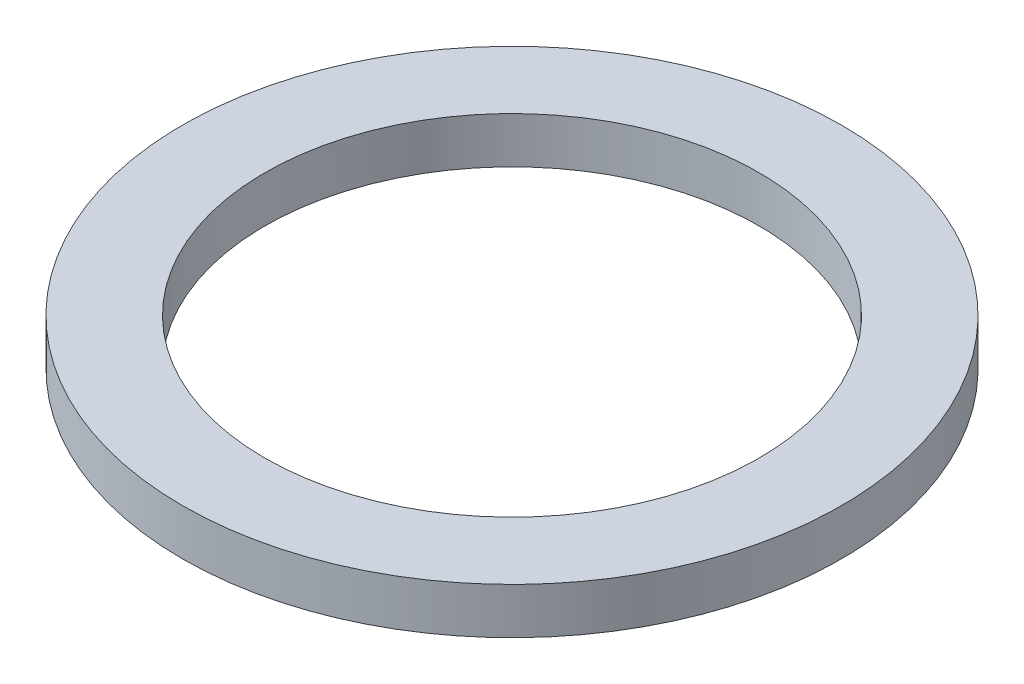
ISO-10303-21;
HEADER;
FILE_DESCRIPTION(('STEP AP214'),'2;1');
FILE_NAME('part.step','',(''),(''),'','','');
FILE_SCHEMA(('AUTOMOTIVE_DESIGN { 1 0 10303 214 1 1 1 1 }'));
ENDSEC;
DATA;
#1=APPLICATION_CONTEXT('core data for automotive mechanical design processes');
#2=APPLICATION_PROTOCOL_DEFINITION('international standard','automotive_design',2000,#1);
#3=PRODUCT_CONTEXT('',#1,'mechanical');
#4=PRODUCT('Part','Part','',(#3));
#5=PRODUCT_RELATED_PRODUCT_CATEGORY('part','',(#4));
#6=PRODUCT_DEFINITION_FORMATION('','',#4);
#7=PRODUCT_DEFINITION_CONTEXT('part definition',#1,'design');
#8=PRODUCT_DEFINITION('design','',#6,#7);
#9=PRODUCT_DEFINITION_SHAPE('','',#8);
#10=(LENGTH_UNIT() NAMED_UNIT(*) SI_UNIT(.MILLI.,.METRE.));
#11=(NAMED_UNIT(*) PLANE_ANGLE_UNIT() SI_UNIT($,.RADIAN.));
#12=(NAMED_UNIT(*) SI_UNIT($,.STERADIAN.) SOLID_ANGLE_UNIT());
#13=UNCERTAINTY_MEASURE_WITH_UNIT(LENGTH_MEASURE(1.E-05),#10,'distance_accuracy_value','');
#14=(GEOMETRIC_REPRESENTATION_CONTEXT(3) GLOBAL_UNCERTAINTY_ASSIGNED_CONTEXT((#13)) GLOBAL_UNIT_ASSIGNED_CONTEXT((#10,
#11,#12)) REPRESENTATION_CONTEXT('',''));
#15=CARTESIAN_POINT('',(0.,0.,0.));
#16=DIRECTION('',(0.,0.,1.));
#17=DIRECTION('',(1.,0.,0.));
#18=AXIS2_PLACEMENT_3D('',#15,#16,#17);
#19=CARTESIAN_POINT('',(0.,1.12,0.));
#20=DIRECTION('',(0.,1.,0.));
#21=DIRECTION('',(0.,0.,1.));
#22=AXIS2_PLACEMENT_3D('',#19,#20,#21);
#23=PLANE('',#22);
#24=CARTESIAN_POINT('',(0.,1.12,0.));
#25=DIRECTION('',(0.,1.,0.));
#26=DIRECTION('',(0.,0.,1.));
#27=AXIS2_PLACEMENT_3D('',#24,#25,#26);
#28=CIRCLE('',#27,8.);
#29=CARTESIAN_POINT('',(0.,1.12,8.));
#30=VERTEX_POINT('',#29);
#31=EDGE_CURVE('E10',#30,#30,#28,.T.);
#32=ORIENTED_EDGE('',*,*,#31,.T.);
#33=EDGE_LOOP('',(#32));
#34=FACE_BOUND('',#33,.T.);
#35=CARTESIAN_POINT('',(0.,1.12,0.));
#36=DIRECTION('',(0.,1.,0.));
#37=DIRECTION('',(0.,0.,1.));
#38=AXIS2_PLACEMENT_3D('',#35,#36,#37);
#39=CIRCLE('',#38,6.00000000000001);
#40=CARTESIAN_POINT('',(0.,1.12,6.00000000000001));
#41=VERTEX_POINT('',#40);
#42=EDGE_CURVE('E45',#41,#41,#39,.T.);
#43=ORIENTED_EDGE('',*,*,#42,.F.);
#44=EDGE_LOOP('',(#43));
#45=FACE_BOUND('',#44,.T.);
#46=ADVANCED_FACE('F34',(#34,#45),#23,.T.);
#47=CARTESIAN_POINT('',(0.,0.,0.));
#48=DIRECTION('',(0.,1.,0.));
#49=DIRECTION('',(0.,0.,1.));
#50=AXIS2_PLACEMENT_3D('',#47,#48,#49);
#51=PLANE('',#50);
#52=CARTESIAN_POINT('',(0.,0.,0.));
#53=DIRECTION('',(0.,1.,0.));
#54=DIRECTION('',(0.,0.,1.));
#55=AXIS2_PLACEMENT_3D('',#52,#53,#54);
#56=CIRCLE('',#55,8.);
#57=CARTESIAN_POINT('',(0.,0.,8.));
#58=VERTEX_POINT('',#57);
#59=EDGE_CURVE('E38',#58,#58,#56,.T.);
#60=ORIENTED_EDGE('',*,*,#59,.F.);
#61=EDGE_LOOP('',(#60));
#62=FACE_BOUND('',#61,.T.);
#63=CARTESIAN_POINT('',(0.,0.,0.));
#64=DIRECTION('',(0.,1.,0.));
#65=DIRECTION('',(0.,0.,1.));
#66=AXIS2_PLACEMENT_3D('',#63,#64,#65);
#67=CIRCLE('',#66,6.00000000000001);
#68=CARTESIAN_POINT('',(0.,0.,6.00000000000001));
#69=VERTEX_POINT('',#68);
#70=EDGE_CURVE('E47',#69,#69,#67,.T.);
#71=ORIENTED_EDGE('',*,*,#70,.T.);
#72=EDGE_LOOP('',(#71));
#73=FACE_BOUND('',#72,.T.);
#74=ADVANCED_FACE('F57',(#62,#73),#51,.F.);
#75=CARTESIAN_POINT('',(0.,1.12,0.));
#76=DIRECTION('',(0.,-1.,0.));
#77=DIRECTION('',(0.,0.,-1.));
#78=AXIS2_PLACEMENT_3D('',#75,#76,#77);
#79=CYLINDRICAL_SURFACE('',#78,8.);
#80=ORIENTED_EDGE('',*,*,#31,.F.);
#81=EDGE_LOOP('',(#80));
#82=FACE_BOUND('',#81,.T.);
#83=ORIENTED_EDGE('',*,*,#59,.T.);
#84=EDGE_LOOP('',(#83));
#85=FACE_BOUND('',#84,.T.);
#86=ADVANCED_FACE('F36',(#82,#85),#79,.T.);
#87=CARTESIAN_POINT('',(0.,1.12,0.));
#88=DIRECTION('',(0.,-1.,0.));
#89=DIRECTION('',(0.,0.,-1.));
#90=AXIS2_PLACEMENT_3D('',#87,#88,#89);
#91=CYLINDRICAL_SURFACE('',#90,6.00000000000001);
#92=ORIENTED_EDGE('',*,*,#42,.T.);
#93=EDGE_LOOP('',(#92));
#94=FACE_BOUND('',#93,.T.);
#95=ORIENTED_EDGE('',*,*,#70,.F.);
#96=EDGE_LOOP('',(#95));
#97=FACE_BOUND('',#96,.T.);
#98=ADVANCED_FACE('F53',(#94,#97),#91,.F.);
#99=CLOSED_SHELL('',(#46,#74,#86,#98));
#100=MANIFOLD_SOLID_BREP('B2',#99);
#101=ADVANCED_BREP_SHAPE_REPRESENTATION('',(#18,#100),#14);
#102=SHAPE_DEFINITION_REPRESENTATION(#9,#101);
ENDSEC;
END-ISO-10303-21;
